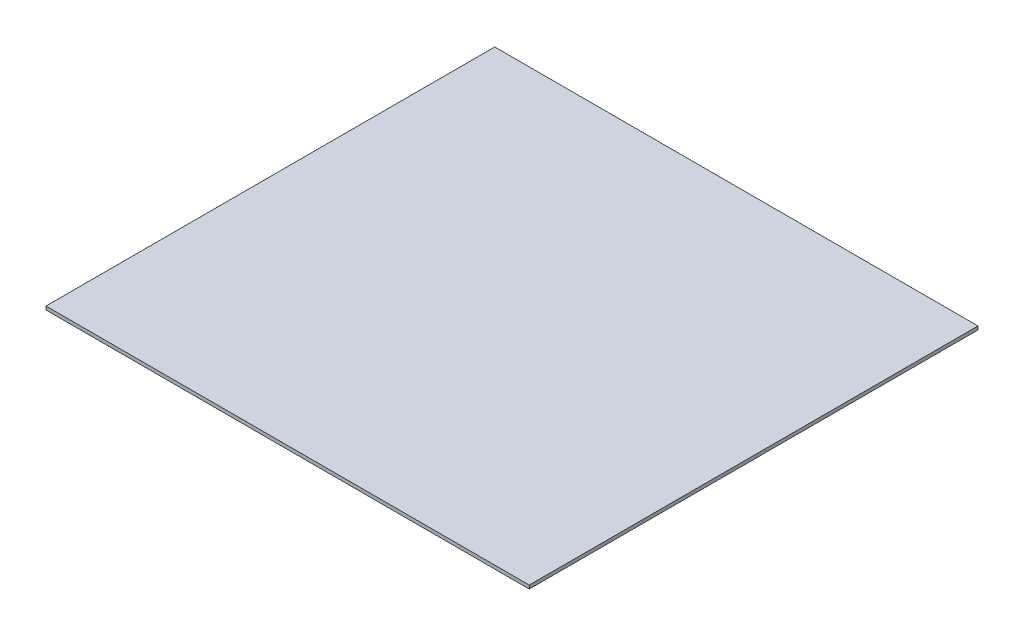
ISO-10303-21;
HEADER;
FILE_DESCRIPTION(('STEP AP214'),'2;1');
FILE_NAME('part.step','',(''),(''),'','','');
FILE_SCHEMA(('AUTOMOTIVE_DESIGN { 1 0 10303 214 1 1 1 1 }'));
ENDSEC;
DATA;
#1=APPLICATION_CONTEXT('core data for automotive mechanical design processes');
#2=APPLICATION_PROTOCOL_DEFINITION('international standard','automotive_design',2000,#1);
#3=PRODUCT_CONTEXT('',#1,'mechanical');
#4=PRODUCT('Part','Part','',(#3));
#5=PRODUCT_RELATED_PRODUCT_CATEGORY('part','',(#4));
#6=PRODUCT_DEFINITION_FORMATION('','',#4);
#7=PRODUCT_DEFINITION_CONTEXT('part definition',#1,'design');
#8=PRODUCT_DEFINITION('design','',#6,#7);
#9=PRODUCT_DEFINITION_SHAPE('','',#8);
#10=(LENGTH_UNIT() NAMED_UNIT(*) SI_UNIT(.MILLI.,.METRE.));
#11=(NAMED_UNIT(*) PLANE_ANGLE_UNIT() SI_UNIT($,.RADIAN.));
#12=(NAMED_UNIT(*) SI_UNIT($,.STERADIAN.) SOLID_ANGLE_UNIT());
#13=UNCERTAINTY_MEASURE_WITH_UNIT(LENGTH_MEASURE(1.E-05),#10,'distance_accuracy_value','');
#14=(GEOMETRIC_REPRESENTATION_CONTEXT(3) GLOBAL_UNCERTAINTY_ASSIGNED_CONTEXT((#13)) GLOBAL_UNIT_ASSIGNED_CONTEXT((#10,
#11,#12)) REPRESENTATION_CONTEXT('',''));
#15=CARTESIAN_POINT('',(0.,0.,0.));
#16=DIRECTION('',(0.,0.,1.));
#17=DIRECTION('',(1.,0.,0.));
#18=AXIS2_PLACEMENT_3D('',#15,#16,#17);
#19=CARTESIAN_POINT('',(-36.3953488372093,0.5,-25.1162790697674));
#20=DIRECTION('',(1.,0.,0.));
#21=DIRECTION('',(0.,0.,-1.));
#22=AXIS2_PLACEMENT_3D('',#19,#20,#21);
#23=PLANE('',#22);
#24=DIRECTION('',(0.,0.,1.));
#25=VECTOR('',#24,1.);
#26=CARTESIAN_POINT('',(-36.3953488372093,0.,-25.1162790697674));
#27=LINE('',#26,#25);
#28=CARTESIAN_POINT('',(-36.3953488372093,0.,-25.1162790697674));
#29=VERTEX_POINT('',#28);
#30=CARTESIAN_POINT('',(-36.3953488372093,0.,39.8837209302326));
#31=VERTEX_POINT('',#30);
#32=EDGE_CURVE('E96',#29,#31,#27,.T.);
#33=ORIENTED_EDGE('',*,*,#32,.T.);
#34=DIRECTION('',(0.,-1.,0.));
#35=VECTOR('',#34,1.);
#36=CARTESIAN_POINT('',(-36.3953488372093,0.5,39.8837209302326));
#37=LINE('',#36,#35);
#38=CARTESIAN_POINT('',(-36.3953488372093,0.5,39.8837209302326));
#39=VERTEX_POINT('',#38);
#40=EDGE_CURVE('E11',#39,#31,#37,.T.);
#41=ORIENTED_EDGE('',*,*,#40,.F.);
#42=DIRECTION('',(0.,0.,1.));
#43=VECTOR('',#42,1.);
#44=CARTESIAN_POINT('',(-36.3953488372093,0.5,-25.1162790697674));
#45=LINE('',#44,#43);
#46=CARTESIAN_POINT('',(-36.3953488372093,0.5,-25.1162790697674));
#47=VERTEX_POINT('',#46);
#48=EDGE_CURVE('E84',#47,#39,#45,.T.);
#49=ORIENTED_EDGE('',*,*,#48,.F.);
#50=DIRECTION('',(0.,-1.,0.));
#51=VECTOR('',#50,1.);
#52=CARTESIAN_POINT('',(-36.3953488372093,0.5,-25.1162790697674));
#53=LINE('',#52,#51);
#54=EDGE_CURVE('E92',#47,#29,#53,.T.);
#55=ORIENTED_EDGE('',*,*,#54,.T.);
#56=EDGE_LOOP('',(#33,#41,#49,#55));
#57=FACE_BOUND('',#56,.T.);
#58=ADVANCED_FACE('F33',(#57),#23,.F.);
#59=CARTESIAN_POINT('',(-36.3953488372093,0.5,39.8837209302326));
#60=DIRECTION('',(0.,0.,-1.));
#61=DIRECTION('',(-1.,0.,0.));
#62=AXIS2_PLACEMENT_3D('',#59,#60,#61);
#63=PLANE('',#62);
#64=DIRECTION('',(1.,0.,0.));
#65=VECTOR('',#64,1.);
#66=CARTESIAN_POINT('',(-36.3953488372093,0.,39.8837209302326));
#67=LINE('',#66,#65);
#68=CARTESIAN_POINT('',(33.6046511627907,0.,39.8837209302326));
#69=VERTEX_POINT('',#68);
#70=EDGE_CURVE('E88',#31,#69,#67,.T.);
#71=ORIENTED_EDGE('',*,*,#70,.T.);
#72=DIRECTION('',(0.,-1.,0.));
#73=VECTOR('',#72,1.);
#74=CARTESIAN_POINT('',(33.6046511627907,0.5,39.8837209302326));
#75=LINE('',#74,#73);
#76=CARTESIAN_POINT('',(33.6046511627907,0.5,39.8837209302326));
#77=VERTEX_POINT('',#76);
#78=EDGE_CURVE('E41',#77,#69,#75,.T.);
#79=ORIENTED_EDGE('',*,*,#78,.F.);
#80=DIRECTION('',(1.,0.,0.));
#81=VECTOR('',#80,1.);
#82=CARTESIAN_POINT('',(-36.3953488372093,0.5,39.8837209302326));
#83=LINE('',#82,#81);
#84=EDGE_CURVE('E79',#39,#77,#83,.T.);
#85=ORIENTED_EDGE('',*,*,#84,.F.);
#86=ORIENTED_EDGE('',*,*,#40,.T.);
#87=EDGE_LOOP('',(#71,#79,#85,#86));
#88=FACE_BOUND('',#87,.T.);
#89=ADVANCED_FACE('F87',(#88),#63,.F.);
#90=CARTESIAN_POINT('',(33.6046511627907,0.5,-25.1162790697674));
#91=DIRECTION('',(-1.,0.,0.));
#92=DIRECTION('',(0.,0.,1.));
#93=AXIS2_PLACEMENT_3D('',#90,#91,#92);
#94=PLANE('',#93);
#95=DIRECTION('',(0.,0.,-1.));
#96=VECTOR('',#95,1.);
#97=CARTESIAN_POINT('',(33.6046511627907,0.,-25.1162790697674));
#98=LINE('',#97,#96);
#99=CARTESIAN_POINT('',(33.6046511627907,0.,-25.1162790697674));
#100=VERTEX_POINT('',#99);
#101=EDGE_CURVE('E66',#69,#100,#98,.T.);
#102=ORIENTED_EDGE('',*,*,#101,.T.);
#103=DIRECTION('',(0.,-1.,0.));
#104=VECTOR('',#103,1.);
#105=CARTESIAN_POINT('',(33.6046511627907,0.5,-25.1162790697674));
#106=LINE('',#105,#104);
#107=CARTESIAN_POINT('',(33.6046511627907,0.5,-25.1162790697674));
#108=VERTEX_POINT('',#107);
#109=EDGE_CURVE('E89',#108,#100,#106,.T.);
#110=ORIENTED_EDGE('',*,*,#109,.F.);
#111=DIRECTION('',(0.,0.,-1.));
#112=VECTOR('',#111,1.);
#113=CARTESIAN_POINT('',(33.6046511627907,0.5,-25.1162790697674));
#114=LINE('',#113,#112);
#115=EDGE_CURVE('E82',#77,#108,#114,.T.);
#116=ORIENTED_EDGE('',*,*,#115,.F.);
#117=ORIENTED_EDGE('',*,*,#78,.T.);
#118=EDGE_LOOP('',(#102,#110,#116,#117));
#119=FACE_BOUND('',#118,.T.);
#120=ADVANCED_FACE('F90',(#119),#94,.F.);
#121=CARTESIAN_POINT('',(-36.3953488372093,0.5,-25.1162790697674));
#122=DIRECTION('',(0.,0.,1.));
#123=DIRECTION('',(1.,0.,0.));
#124=AXIS2_PLACEMENT_3D('',#121,#122,#123);
#125=PLANE('',#124);
#126=DIRECTION('',(-1.,0.,0.));
#127=VECTOR('',#126,1.);
#128=CARTESIAN_POINT('',(-36.3953488372093,0.,-25.1162790697674));
#129=LINE('',#128,#127);
#130=EDGE_CURVE('E72',#100,#29,#129,.T.);
#131=ORIENTED_EDGE('',*,*,#130,.T.);
#132=ORIENTED_EDGE('',*,*,#54,.F.);
#133=DIRECTION('',(-1.,0.,0.));
#134=VECTOR('',#133,1.);
#135=CARTESIAN_POINT('',(-36.3953488372093,0.5,-25.1162790697674));
#136=LINE('',#135,#134);
#137=EDGE_CURVE('E49',#108,#47,#136,.T.);
#138=ORIENTED_EDGE('',*,*,#137,.F.);
#139=ORIENTED_EDGE('',*,*,#109,.T.);
#140=EDGE_LOOP('',(#131,#132,#138,#139));
#141=FACE_BOUND('',#140,.T.);
#142=ADVANCED_FACE('F103',(#141),#125,.F.);
#143=CARTESIAN_POINT('',(0.,0.5,0.));
#144=DIRECTION('',(0.,1.,0.));
#145=DIRECTION('',(0.,0.,1.));
#146=AXIS2_PLACEMENT_3D('',#143,#144,#145);
#147=PLANE('',#146);
#148=ORIENTED_EDGE('',*,*,#48,.T.);
#149=ORIENTED_EDGE('',*,*,#84,.T.);
#150=ORIENTED_EDGE('',*,*,#115,.T.);
#151=ORIENTED_EDGE('',*,*,#137,.T.);
#152=EDGE_LOOP('',(#148,#149,#150,#151));
#153=FACE_BOUND('',#152,.T.);
#154=ADVANCED_FACE('F80',(#153),#147,.T.);
#155=CARTESIAN_POINT('',(0.,0.,0.));
#156=DIRECTION('',(0.,1.,0.));
#157=DIRECTION('',(0.,0.,1.));
#158=AXIS2_PLACEMENT_3D('',#155,#156,#157);
#159=PLANE('',#158);
#160=ORIENTED_EDGE('',*,*,#32,.F.);
#161=ORIENTED_EDGE('',*,*,#130,.F.);
#162=ORIENTED_EDGE('',*,*,#101,.F.);
#163=ORIENTED_EDGE('',*,*,#70,.F.);
#164=EDGE_LOOP('',(#160,#161,#162,#163));
#165=FACE_BOUND('',#164,.T.);
#166=ADVANCED_FACE('F106',(#165),#159,.F.);
#167=CLOSED_SHELL('',(#58,#89,#120,#142,#154,#166));
#168=MANIFOLD_SOLID_BREP('B2',#167);
#169=ADVANCED_BREP_SHAPE_REPRESENTATION('',(#18,#168),#14);
#170=SHAPE_DEFINITION_REPRESENTATION(#9,#169);
ENDSEC;
END-ISO-10303-21;
